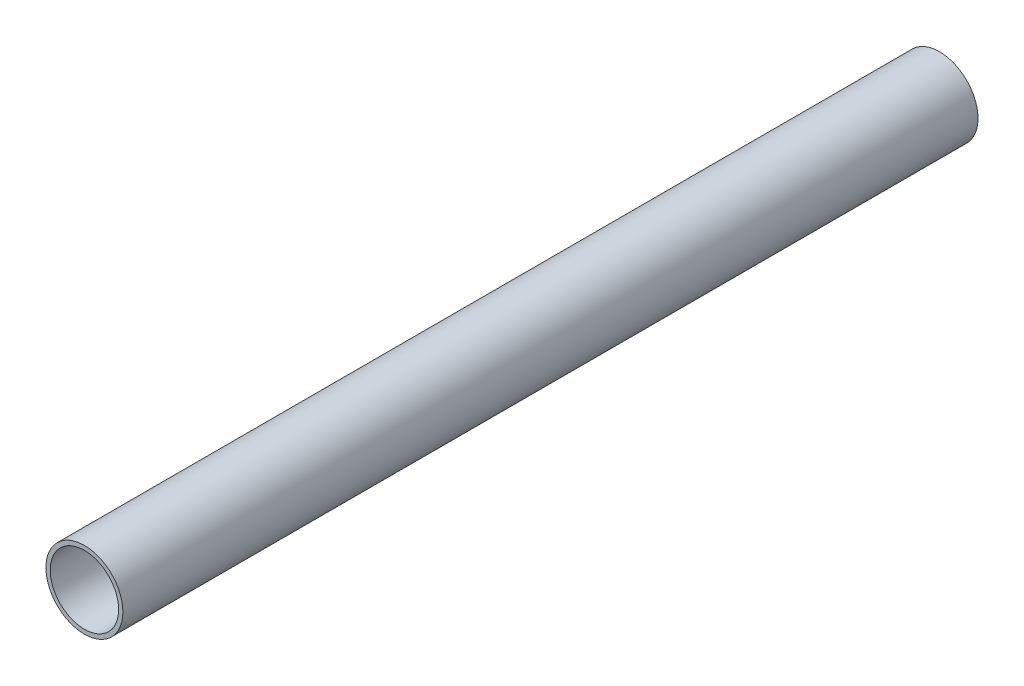
ISO-10303-21;
HEADER;
FILE_DESCRIPTION(('STEP AP214'),'2;1');
FILE_NAME('part.step','',(''),(''),'','','');
FILE_SCHEMA(('AUTOMOTIVE_DESIGN { 1 0 10303 214 1 1 1 1 }'));
ENDSEC;
DATA;
#1=APPLICATION_CONTEXT('core data for automotive mechanical design processes');
#2=APPLICATION_PROTOCOL_DEFINITION('international standard','automotive_design',2000,#1);
#3=PRODUCT_CONTEXT('',#1,'mechanical');
#4=PRODUCT('Part','Part','',(#3));
#5=PRODUCT_RELATED_PRODUCT_CATEGORY('part','',(#4));
#6=PRODUCT_DEFINITION_FORMATION('','',#4);
#7=PRODUCT_DEFINITION_CONTEXT('part definition',#1,'design');
#8=PRODUCT_DEFINITION('design','',#6,#7);
#9=PRODUCT_DEFINITION_SHAPE('','',#8);
#10=(LENGTH_UNIT() NAMED_UNIT(*) SI_UNIT(.MILLI.,.METRE.));
#11=(NAMED_UNIT(*) PLANE_ANGLE_UNIT() SI_UNIT($,.RADIAN.));
#12=(NAMED_UNIT(*) SI_UNIT($,.STERADIAN.) SOLID_ANGLE_UNIT());
#13=UNCERTAINTY_MEASURE_WITH_UNIT(LENGTH_MEASURE(1.E-05),#10,'distance_accuracy_value','');
#14=(GEOMETRIC_REPRESENTATION_CONTEXT(3) GLOBAL_UNCERTAINTY_ASSIGNED_CONTEXT((#13)) GLOBAL_UNIT_ASSIGNED_CONTEXT((#10,
#11,#12)) REPRESENTATION_CONTEXT('',''));
#15=CARTESIAN_POINT('',(0.,0.,0.));
#16=DIRECTION('',(0.,0.,1.));
#17=DIRECTION('',(1.,0.,0.));
#18=AXIS2_PLACEMENT_3D('',#15,#16,#17);
#19=CARTESIAN_POINT('',(0.,0.,50.));
#20=DIRECTION('',(0.,0.,1.));
#21=DIRECTION('',(1.,0.,0.));
#22=AXIS2_PLACEMENT_3D('',#19,#20,#21);
#23=PLANE('',#22);
#24=CARTESIAN_POINT('',(0.,0.,50.));
#25=DIRECTION('',(0.,0.,1.));
#26=DIRECTION('',(1.,0.,0.));
#27=AXIS2_PLACEMENT_3D('',#24,#25,#26);
#28=CIRCLE('',#27,2.25);
#29=CARTESIAN_POINT('',(2.25,0.,50.));
#30=VERTEX_POINT('',#29);
#31=EDGE_CURVE('E10',#30,#30,#28,.T.);
#32=ORIENTED_EDGE('',*,*,#31,.T.);
#33=EDGE_LOOP('',(#32));
#34=FACE_BOUND('',#33,.T.);
#35=CARTESIAN_POINT('',(0.,0.,50.));
#36=DIRECTION('',(0.,0.,1.));
#37=DIRECTION('',(1.,0.,0.));
#38=AXIS2_PLACEMENT_3D('',#35,#36,#37);
#39=CIRCLE('',#38,2.);
#40=CARTESIAN_POINT('',(2.,0.,50.));
#41=VERTEX_POINT('',#40);
#42=EDGE_CURVE('E54',#41,#41,#39,.T.);
#43=ORIENTED_EDGE('',*,*,#42,.F.);
#44=EDGE_LOOP('',(#43));
#45=FACE_BOUND('',#44,.T.);
#46=ADVANCED_FACE('F40',(#34,#45),#23,.T.);
#47=CARTESIAN_POINT('',(0.,0.,0.));
#48=DIRECTION('',(0.,0.,1.));
#49=DIRECTION('',(1.,0.,0.));
#50=AXIS2_PLACEMENT_3D('',#47,#48,#49);
#51=PLANE('',#50);
#52=CARTESIAN_POINT('',(0.,0.,0.));
#53=DIRECTION('',(0.,0.,1.));
#54=DIRECTION('',(1.,0.,0.));
#55=AXIS2_PLACEMENT_3D('',#52,#53,#54);
#56=CIRCLE('',#55,2.25);
#57=CARTESIAN_POINT('',(2.25,0.,0.));
#58=VERTEX_POINT('',#57);
#59=EDGE_CURVE('E44',#58,#58,#56,.T.);
#60=ORIENTED_EDGE('',*,*,#59,.F.);
#61=EDGE_LOOP('',(#60));
#62=FACE_BOUND('',#61,.T.);
#63=CARTESIAN_POINT('',(0.,0.,0.));
#64=DIRECTION('',(0.,0.,1.));
#65=DIRECTION('',(1.,0.,0.));
#66=AXIS2_PLACEMENT_3D('',#63,#64,#65);
#67=CIRCLE('',#66,2.);
#68=CARTESIAN_POINT('',(2.,0.,0.));
#69=VERTEX_POINT('',#68);
#70=EDGE_CURVE('E56',#69,#69,#67,.T.);
#71=ORIENTED_EDGE('',*,*,#70,.T.);
#72=EDGE_LOOP('',(#71));
#73=FACE_BOUND('',#72,.T.);
#74=ADVANCED_FACE('F69',(#62,#73),#51,.F.);
#75=CARTESIAN_POINT('',(0.,0.,50.));
#76=DIRECTION('',(0.,0.,-1.));
#77=DIRECTION('',(-1.,0.,0.));
#78=AXIS2_PLACEMENT_3D('',#75,#76,#77);
#79=CYLINDRICAL_SURFACE('',#78,2.25);
#80=ORIENTED_EDGE('',*,*,#31,.F.);
#81=EDGE_LOOP('',(#80));
#82=FACE_BOUND('',#81,.T.);
#83=ORIENTED_EDGE('',*,*,#59,.T.);
#84=EDGE_LOOP('',(#83));
#85=FACE_BOUND('',#84,.T.);
#86=ADVANCED_FACE('F42',(#82,#85),#79,.T.);
#87=CARTESIAN_POINT('',(0.,0.,50.));
#88=DIRECTION('',(0.,0.,-1.));
#89=DIRECTION('',(-1.,0.,0.));
#90=AXIS2_PLACEMENT_3D('',#87,#88,#89);
#91=CYLINDRICAL_SURFACE('',#90,2.);
#92=ORIENTED_EDGE('',*,*,#42,.T.);
#93=EDGE_LOOP('',(#92));
#94=FACE_BOUND('',#93,.T.);
#95=ORIENTED_EDGE('',*,*,#70,.F.);
#96=EDGE_LOOP('',(#95));
#97=FACE_BOUND('',#96,.T.);
#98=ADVANCED_FACE('F65',(#94,#97),#91,.F.);
#99=CLOSED_SHELL('',(#46,#74,#86,#98));
#100=MANIFOLD_SOLID_BREP('B2',#99);
#101=ADVANCED_BREP_SHAPE_REPRESENTATION('',(#18,#100),#14);
#102=SHAPE_DEFINITION_REPRESENTATION(#9,#101);
ENDSEC;
END-ISO-10303-21;
